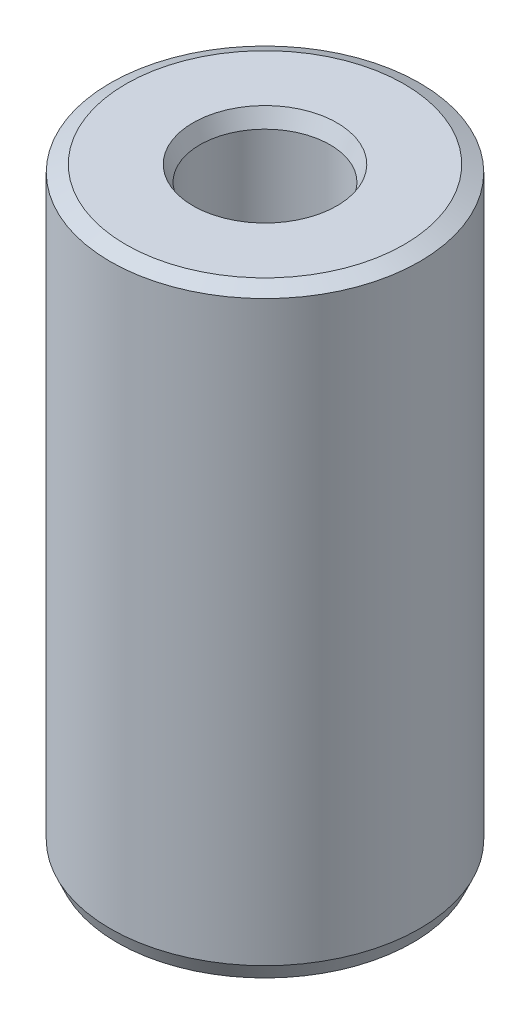
ISO-10303-21;
HEADER;
FILE_DESCRIPTION(('STEP AP214'),'2;1');
FILE_NAME('part.step','',(''),(''),'','','');
FILE_SCHEMA(('AUTOMOTIVE_DESIGN { 1 0 10303 214 1 1 1 1 }'));
ENDSEC;
DATA;
#1=APPLICATION_CONTEXT('core data for automotive mechanical design processes');
#2=APPLICATION_PROTOCOL_DEFINITION('international standard','automotive_design',2000,#1);
#3=PRODUCT_CONTEXT('',#1,'mechanical');
#4=PRODUCT('Part','Part','',(#3));
#5=PRODUCT_RELATED_PRODUCT_CATEGORY('part','',(#4));
#6=PRODUCT_DEFINITION_FORMATION('','',#4);
#7=PRODUCT_DEFINITION_CONTEXT('part definition',#1,'design');
#8=PRODUCT_DEFINITION('design','',#6,#7);
#9=PRODUCT_DEFINITION_SHAPE('','',#8);
#10=(LENGTH_UNIT() NAMED_UNIT(*) SI_UNIT(.MILLI.,.METRE.));
#11=(NAMED_UNIT(*) PLANE_ANGLE_UNIT() SI_UNIT($,.RADIAN.));
#12=(NAMED_UNIT(*) SI_UNIT($,.STERADIAN.) SOLID_ANGLE_UNIT());
#13=UNCERTAINTY_MEASURE_WITH_UNIT(LENGTH_MEASURE(1.E-05),#10,'distance_accuracy_value','');
#14=(GEOMETRIC_REPRESENTATION_CONTEXT(3) GLOBAL_UNCERTAINTY_ASSIGNED_CONTEXT((#13)) GLOBAL_UNIT_ASSIGNED_CONTEXT((#10,
#11,#12)) REPRESENTATION_CONTEXT('',''));
#15=CARTESIAN_POINT('',(0.,0.,0.));
#16=DIRECTION('',(0.,0.,1.));
#17=DIRECTION('',(1.,0.,0.));
#18=AXIS2_PLACEMENT_3D('',#15,#16,#17);
#19=CARTESIAN_POINT('',(0.,213.398398542868,0.));
#20=DIRECTION('',(0.,-1.,0.));
#21=DIRECTION('',(0.,0.,-1.));
#22=AXIS2_PLACEMENT_3D('',#19,#20,#21);
#23=CYLINDRICAL_SURFACE('',#22,55.);
#24=CARTESIAN_POINT('',(0.,5.5301020208029,0.));
#25=DIRECTION('',(0.,1.,0.));
#26=DIRECTION('',(0.,0.,1.));
#27=AXIS2_PLACEMENT_3D('',#24,#25,#26);
#28=CIRCLE('',#27,55.);
#29=CARTESIAN_POINT('',(0.,5.5301020208029,55.));
#30=VERTEX_POINT('',#29);
#31=EDGE_CURVE('E10',#30,#30,#28,.T.);
#32=ORIENTED_EDGE('',*,*,#31,.T.);
#33=EDGE_LOOP('',(#32));
#34=FACE_BOUND('',#33,.T.);
#35=CARTESIAN_POINT('',(0.,210.93216728732,0.));
#36=DIRECTION('',(0.,1.,0.));
#37=DIRECTION('',(0.,0.,1.));
#38=AXIS2_PLACEMENT_3D('',#35,#36,#37);
#39=CIRCLE('',#38,55.);
#40=CARTESIAN_POINT('',(0.,210.93216728732,55.));
#41=VERTEX_POINT('',#40);
#42=EDGE_CURVE('E50',#41,#41,#39,.F.);
#43=ORIENTED_EDGE('',*,*,#42,.T.);
#44=EDGE_LOOP('',(#43));
#45=FACE_BOUND('',#44,.T.);
#46=ADVANCED_FACE('F39',(#34,#45),#23,.T.);
#47=CARTESIAN_POINT('',(0.,213.398398542868,0.));
#48=DIRECTION('',(0.,1.,0.));
#49=DIRECTION('',(0.,0.,1.));
#50=AXIS2_PLACEMENT_3D('',#47,#48,#49);
#51=PLANE('',#50);
#52=CARTESIAN_POINT('',(0.,213.398398542868,0.));
#53=DIRECTION('',(0.,1.,0.));
#54=DIRECTION('',(0.,0.,1.));
#55=AXIS2_PLACEMENT_3D('',#52,#53,#54);
#56=CIRCLE('',#55,25.5963561467995);
#57=CARTESIAN_POINT('',(0.,213.398398542868,25.5963561467995));
#58=VERTEX_POINT('',#57);
#59=EDGE_CURVE('E58',#58,#58,#56,.F.);
#60=ORIENTED_EDGE('',*,*,#59,.T.);
#61=EDGE_LOOP('',(#60));
#62=FACE_BOUND('',#61,.T.);
#63=CARTESIAN_POINT('',(0.,213.398398542868,0.));
#64=DIRECTION('',(0.,1.,0.));
#65=DIRECTION('',(0.,0.,1.));
#66=AXIS2_PLACEMENT_3D('',#63,#64,#65);
#67=CIRCLE('',#66,49.4698979791971);
#68=CARTESIAN_POINT('',(0.,213.398398542868,49.4698979791971));
#69=VERTEX_POINT('',#68);
#70=EDGE_CURVE('E61',#69,#69,#67,.T.);
#71=ORIENTED_EDGE('',*,*,#70,.T.);
#72=EDGE_LOOP('',(#71));
#73=FACE_BOUND('',#72,.T.);
#74=ADVANCED_FACE('F88',(#62,#73),#51,.T.);
#75=CARTESIAN_POINT('',(0.,0.,0.));
#76=DIRECTION('',(0.,1.,0.));
#77=DIRECTION('',(0.,0.,1.));
#78=AXIS2_PLACEMENT_3D('',#75,#76,#77);
#79=PLANE('',#78);
#80=CARTESIAN_POINT('',(0.,0.,0.));
#81=DIRECTION('',(0.,1.,0.));
#82=DIRECTION('',(0.,0.,1.));
#83=AXIS2_PLACEMENT_3D('',#80,#81,#82);
#84=CIRCLE('',#83,28.6602269120546);
#85=CARTESIAN_POINT('',(0.,0.,28.6602269120546));
#86=VERTEX_POINT('',#85);
#87=EDGE_CURVE('E51',#86,#86,#84,.T.);
#88=ORIENTED_EDGE('',*,*,#87,.T.);
#89=EDGE_LOOP('',(#88));
#90=FACE_BOUND('',#89,.T.);
#91=CARTESIAN_POINT('',(0.,0.,0.));
#92=DIRECTION('',(0.,1.,0.));
#93=DIRECTION('',(0.,0.,1.));
#94=AXIS2_PLACEMENT_3D('',#91,#92,#93);
#95=CIRCLE('',#94,52.5337687444522);
#96=CARTESIAN_POINT('',(0.,0.,52.5337687444522));
#97=VERTEX_POINT('',#96);
#98=EDGE_CURVE('E54',#97,#97,#95,.F.);
#99=ORIENTED_EDGE('',*,*,#98,.T.);
#100=EDGE_LOOP('',(#99));
#101=FACE_BOUND('',#100,.T.);
#102=ADVANCED_FACE('F83',(#90,#101),#79,.F.);
#103=CARTESIAN_POINT('',(0.,213.398398542868,0.));
#104=DIRECTION('',(0.,-1.,0.));
#105=DIRECTION('',(0.,0.,-1.));
#106=AXIS2_PLACEMENT_3D('',#103,#104,#105);
#107=CYLINDRICAL_SURFACE('',#106,23.1301248912517);
#108=CARTESIAN_POINT('',(0.,207.868296522065,0.));
#109=DIRECTION('',(0.,1.,0.));
#110=DIRECTION('',(0.,0.,1.));
#111=AXIS2_PLACEMENT_3D('',#108,#109,#110);
#112=CIRCLE('',#111,23.1301248912517);
#113=CARTESIAN_POINT('',(0.,207.868296522065,23.1301248912517));
#114=VERTEX_POINT('',#113);
#115=EDGE_CURVE('E67',#114,#114,#112,.T.);
#116=ORIENTED_EDGE('',*,*,#115,.T.);
#117=EDGE_LOOP('',(#116));
#118=FACE_BOUND('',#117,.T.);
#119=CARTESIAN_POINT('',(0.,2.46623125554774,0.));
#120=DIRECTION('',(0.,1.,0.));
#121=DIRECTION('',(0.,0.,1.));
#122=AXIS2_PLACEMENT_3D('',#119,#120,#121);
#123=CIRCLE('',#122,23.1301248912517);
#124=CARTESIAN_POINT('',(0.,2.46623125554774,23.1301248912517));
#125=VERTEX_POINT('',#124);
#126=EDGE_CURVE('E69',#125,#125,#123,.F.);
#127=ORIENTED_EDGE('',*,*,#126,.T.);
#128=EDGE_LOOP('',(#127));
#129=FACE_BOUND('',#128,.T.);
#130=ADVANCED_FACE('F71',(#118,#129),#107,.F.);
#131=CARTESIAN_POINT('',(0.,207.868296522065,0.));
#132=DIRECTION('',(0.,1.,0.));
#133=DIRECTION('',(0.,0.,1.));
#134=AXIS2_PLACEMENT_3D('',#131,#132,#133);
#135=CONICAL_SURFACE('',#134,23.1301248912517,0.419493250617825);
#136=ORIENTED_EDGE('',*,*,#59,.F.);
#137=EDGE_LOOP('',(#136));
#138=FACE_BOUND('',#137,.T.);
#139=ORIENTED_EDGE('',*,*,#115,.F.);
#140=EDGE_LOOP('',(#139));
#141=FACE_BOUND('',#140,.T.);
#142=ADVANCED_FACE('F77',(#138,#141),#135,.F.);
#143=CARTESIAN_POINT('',(0.,0.,0.));
#144=DIRECTION('',(0.,-1.,0.));
#145=DIRECTION('',(0.,0.,-1.));
#146=AXIS2_PLACEMENT_3D('',#143,#144,#145);
#147=CONICAL_SURFACE('',#146,28.6602269120546,1.15130307617707);
#148=ORIENTED_EDGE('',*,*,#126,.F.);
#149=EDGE_LOOP('',(#148));
#150=FACE_BOUND('',#149,.T.);
#151=ORIENTED_EDGE('',*,*,#87,.F.);
#152=EDGE_LOOP('',(#151));
#153=FACE_BOUND('',#152,.T.);
#154=ADVANCED_FACE('F73',(#150,#153),#147,.F.);
#155=CARTESIAN_POINT('',(0.,5.5301020208029,0.));
#156=DIRECTION('',(0.,1.,0.));
#157=DIRECTION('',(0.,0.,1.));
#158=AXIS2_PLACEMENT_3D('',#155,#156,#157);
#159=CONICAL_SURFACE('',#158,55.,0.419493250617831);
#160=ORIENTED_EDGE('',*,*,#98,.F.);
#161=EDGE_LOOP('',(#160));
#162=FACE_BOUND('',#161,.T.);
#163=ORIENTED_EDGE('',*,*,#31,.F.);
#164=EDGE_LOOP('',(#163));
#165=FACE_BOUND('',#164,.T.);
#166=ADVANCED_FACE('F76',(#162,#165),#159,.T.);
#167=CARTESIAN_POINT('',(0.,213.398398542868,0.));
#168=DIRECTION('',(0.,-1.,0.));
#169=DIRECTION('',(0.,0.,-1.));
#170=AXIS2_PLACEMENT_3D('',#167,#168,#169);
#171=CONICAL_SURFACE('',#170,49.4698979791971,1.15130307617707);
#172=ORIENTED_EDGE('',*,*,#42,.F.);
#173=EDGE_LOOP('',(#172));
#174=FACE_BOUND('',#173,.T.);
#175=ORIENTED_EDGE('',*,*,#70,.F.);
#176=EDGE_LOOP('',(#175));
#177=FACE_BOUND('',#176,.T.);
#178=ADVANCED_FACE('F45',(#174,#177),#171,.T.);
#179=CLOSED_SHELL('',(#46,#74,#102,#130,#142,#154,#166,#178));
#180=MANIFOLD_SOLID_BREP('B2',#179);
#181=ADVANCED_BREP_SHAPE_REPRESENTATION('',(#18,#180),#14);
#182=SHAPE_DEFINITION_REPRESENTATION(#9,#181);
ENDSEC;
END-ISO-10303-21;
